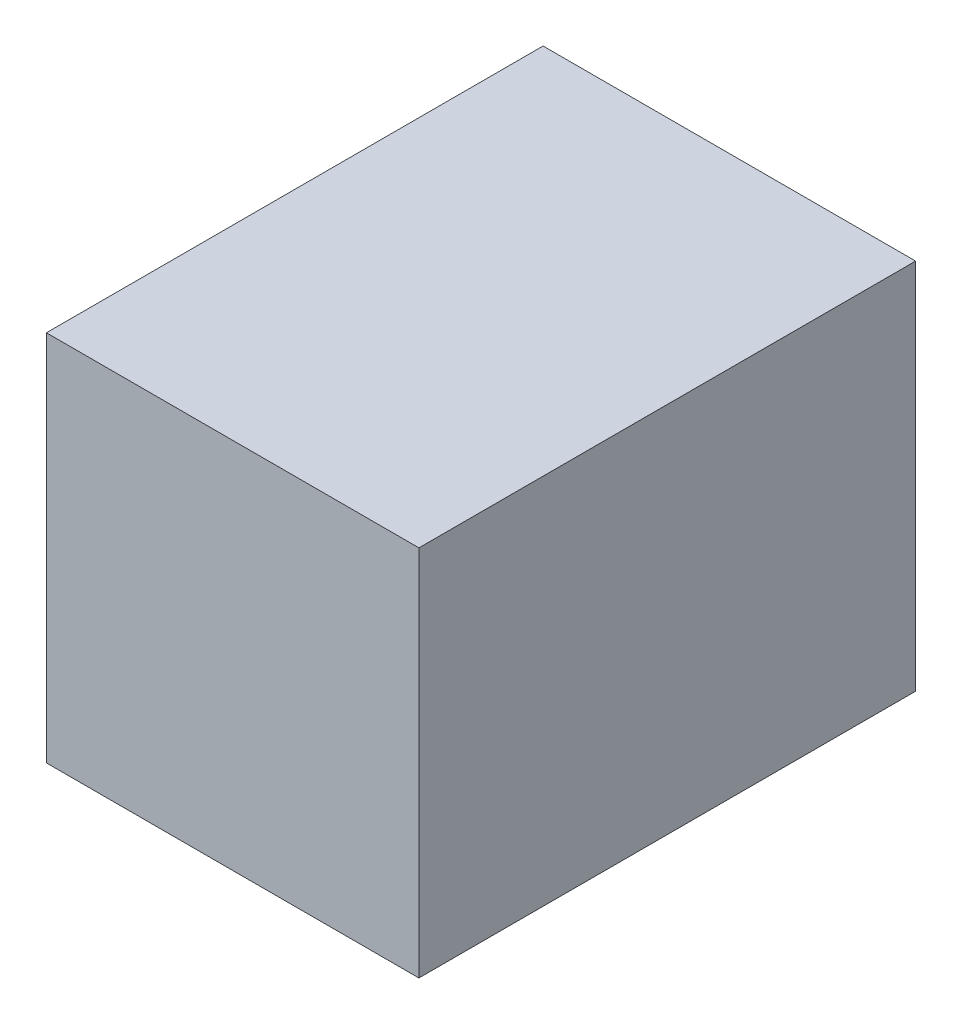
ISO-10303-21;
HEADER;
FILE_DESCRIPTION(('STEP AP214'),'2;1');
FILE_NAME('part.step','',(''),(''),'','','');
FILE_SCHEMA(('AUTOMOTIVE_DESIGN { 1 0 10303 214 1 1 1 1 }'));
ENDSEC;
DATA;
#1=APPLICATION_CONTEXT('core data for automotive mechanical design processes');
#2=APPLICATION_PROTOCOL_DEFINITION('international standard','automotive_design',2000,#1);
#3=PRODUCT_CONTEXT('',#1,'mechanical');
#4=PRODUCT('Part','Part','',(#3));
#5=PRODUCT_RELATED_PRODUCT_CATEGORY('part','',(#4));
#6=PRODUCT_DEFINITION_FORMATION('','',#4);
#7=PRODUCT_DEFINITION_CONTEXT('part definition',#1,'design');
#8=PRODUCT_DEFINITION('design','',#6,#7);
#9=PRODUCT_DEFINITION_SHAPE('','',#8);
#10=(LENGTH_UNIT() NAMED_UNIT(*) SI_UNIT(.MILLI.,.METRE.));
#11=(NAMED_UNIT(*) PLANE_ANGLE_UNIT() SI_UNIT($,.RADIAN.));
#12=(NAMED_UNIT(*) SI_UNIT($,.STERADIAN.) SOLID_ANGLE_UNIT());
#13=UNCERTAINTY_MEASURE_WITH_UNIT(LENGTH_MEASURE(1.E-05),#10,'distance_accuracy_value','');
#14=(GEOMETRIC_REPRESENTATION_CONTEXT(3) GLOBAL_UNCERTAINTY_ASSIGNED_CONTEXT((#13)) GLOBAL_UNIT_ASSIGNED_CONTEXT((#10,
#11,#12)) REPRESENTATION_CONTEXT('',''));
#15=CARTESIAN_POINT('',(0.,0.,0.));
#16=DIRECTION('',(0.,0.,1.));
#17=DIRECTION('',(1.,0.,0.));
#18=AXIS2_PLACEMENT_3D('',#15,#16,#17);
#19=CARTESIAN_POINT('',(3.,-3.,8.));
#20=DIRECTION('',(-1.,0.,0.));
#21=DIRECTION('',(0.,0.,1.));
#22=AXIS2_PLACEMENT_3D('',#19,#20,#21);
#23=PLANE('',#22);
#24=DIRECTION('',(0.,1.,0.));
#25=VECTOR('',#24,1.);
#26=CARTESIAN_POINT('',(3.,-3.,0.));
#27=LINE('',#26,#25);
#28=CARTESIAN_POINT('',(3.,-3.,0.));
#29=VERTEX_POINT('',#28);
#30=CARTESIAN_POINT('',(3.,3.,0.));
#31=VERTEX_POINT('',#30);
#32=EDGE_CURVE('E96',#29,#31,#27,.T.);
#33=ORIENTED_EDGE('',*,*,#32,.T.);
#34=DIRECTION('',(0.,0.,-1.));
#35=VECTOR('',#34,1.);
#36=CARTESIAN_POINT('',(3.,3.,8.));
#37=LINE('',#36,#35);
#38=CARTESIAN_POINT('',(3.,3.,8.));
#39=VERTEX_POINT('',#38);
#40=EDGE_CURVE('E11',#39,#31,#37,.T.);
#41=ORIENTED_EDGE('',*,*,#40,.F.);
#42=DIRECTION('',(0.,1.,0.));
#43=VECTOR('',#42,1.);
#44=CARTESIAN_POINT('',(3.,-3.,8.));
#45=LINE('',#44,#43);
#46=CARTESIAN_POINT('',(3.,-3.,8.));
#47=VERTEX_POINT('',#46);
#48=EDGE_CURVE('E84',#47,#39,#45,.T.);
#49=ORIENTED_EDGE('',*,*,#48,.F.);
#50=DIRECTION('',(0.,0.,-1.));
#51=VECTOR('',#50,1.);
#52=CARTESIAN_POINT('',(3.,-3.,8.));
#53=LINE('',#52,#51);
#54=EDGE_CURVE('E92',#47,#29,#53,.T.);
#55=ORIENTED_EDGE('',*,*,#54,.T.);
#56=EDGE_LOOP('',(#33,#41,#49,#55));
#57=FACE_BOUND('',#56,.T.);
#58=ADVANCED_FACE('F33',(#57),#23,.F.);
#59=CARTESIAN_POINT('',(-3.,3.,8.));
#60=DIRECTION('',(0.,-1.,0.));
#61=DIRECTION('',(0.,0.,-1.));
#62=AXIS2_PLACEMENT_3D('',#59,#60,#61);
#63=PLANE('',#62);
#64=DIRECTION('',(-1.,0.,0.));
#65=VECTOR('',#64,1.);
#66=CARTESIAN_POINT('',(-3.,3.,0.));
#67=LINE('',#66,#65);
#68=CARTESIAN_POINT('',(-3.,3.,0.));
#69=VERTEX_POINT('',#68);
#70=EDGE_CURVE('E88',#31,#69,#67,.T.);
#71=ORIENTED_EDGE('',*,*,#70,.T.);
#72=DIRECTION('',(0.,0.,-1.));
#73=VECTOR('',#72,1.);
#74=CARTESIAN_POINT('',(-3.,3.,8.));
#75=LINE('',#74,#73);
#76=CARTESIAN_POINT('',(-3.,3.,8.));
#77=VERTEX_POINT('',#76);
#78=EDGE_CURVE('E41',#77,#69,#75,.T.);
#79=ORIENTED_EDGE('',*,*,#78,.F.);
#80=DIRECTION('',(-1.,0.,0.));
#81=VECTOR('',#80,1.);
#82=CARTESIAN_POINT('',(-3.,3.,8.));
#83=LINE('',#82,#81);
#84=EDGE_CURVE('E79',#39,#77,#83,.T.);
#85=ORIENTED_EDGE('',*,*,#84,.F.);
#86=ORIENTED_EDGE('',*,*,#40,.T.);
#87=EDGE_LOOP('',(#71,#79,#85,#86));
#88=FACE_BOUND('',#87,.T.);
#89=ADVANCED_FACE('F87',(#88),#63,.F.);
#90=CARTESIAN_POINT('',(-3.,-3.,8.));
#91=DIRECTION('',(1.,0.,0.));
#92=DIRECTION('',(0.,0.,-1.));
#93=AXIS2_PLACEMENT_3D('',#90,#91,#92);
#94=PLANE('',#93);
#95=DIRECTION('',(0.,-1.,0.));
#96=VECTOR('',#95,1.);
#97=CARTESIAN_POINT('',(-3.,-3.,0.));
#98=LINE('',#97,#96);
#99=CARTESIAN_POINT('',(-3.,-3.,0.));
#100=VERTEX_POINT('',#99);
#101=EDGE_CURVE('E66',#69,#100,#98,.T.);
#102=ORIENTED_EDGE('',*,*,#101,.T.);
#103=DIRECTION('',(0.,0.,-1.));
#104=VECTOR('',#103,1.);
#105=CARTESIAN_POINT('',(-3.,-3.,8.));
#106=LINE('',#105,#104);
#107=CARTESIAN_POINT('',(-3.,-3.,8.));
#108=VERTEX_POINT('',#107);
#109=EDGE_CURVE('E89',#108,#100,#106,.T.);
#110=ORIENTED_EDGE('',*,*,#109,.F.);
#111=DIRECTION('',(0.,-1.,0.));
#112=VECTOR('',#111,1.);
#113=CARTESIAN_POINT('',(-3.,-3.,8.));
#114=LINE('',#113,#112);
#115=EDGE_CURVE('E82',#77,#108,#114,.T.);
#116=ORIENTED_EDGE('',*,*,#115,.F.);
#117=ORIENTED_EDGE('',*,*,#78,.T.);
#118=EDGE_LOOP('',(#102,#110,#116,#117));
#119=FACE_BOUND('',#118,.T.);
#120=ADVANCED_FACE('F90',(#119),#94,.F.);
#121=CARTESIAN_POINT('',(-3.,-3.,8.));
#122=DIRECTION('',(0.,1.,0.));
#123=DIRECTION('',(0.,0.,1.));
#124=AXIS2_PLACEMENT_3D('',#121,#122,#123);
#125=PLANE('',#124);
#126=DIRECTION('',(1.,0.,0.));
#127=VECTOR('',#126,1.);
#128=CARTESIAN_POINT('',(-3.,-3.,0.));
#129=LINE('',#128,#127);
#130=EDGE_CURVE('E72',#100,#29,#129,.T.);
#131=ORIENTED_EDGE('',*,*,#130,.T.);
#132=ORIENTED_EDGE('',*,*,#54,.F.);
#133=DIRECTION('',(1.,0.,0.));
#134=VECTOR('',#133,1.);
#135=CARTESIAN_POINT('',(-3.,-3.,8.));
#136=LINE('',#135,#134);
#137=EDGE_CURVE('E49',#108,#47,#136,.T.);
#138=ORIENTED_EDGE('',*,*,#137,.F.);
#139=ORIENTED_EDGE('',*,*,#109,.T.);
#140=EDGE_LOOP('',(#131,#132,#138,#139));
#141=FACE_BOUND('',#140,.T.);
#142=ADVANCED_FACE('F103',(#141),#125,.F.);
#143=CARTESIAN_POINT('',(0.,0.,8.));
#144=DIRECTION('',(0.,0.,-1.));
#145=DIRECTION('',(-1.,0.,0.));
#146=AXIS2_PLACEMENT_3D('',#143,#144,#145);
#147=PLANE('',#146);
#148=ORIENTED_EDGE('',*,*,#48,.T.);
#149=ORIENTED_EDGE('',*,*,#84,.T.);
#150=ORIENTED_EDGE('',*,*,#115,.T.);
#151=ORIENTED_EDGE('',*,*,#137,.T.);
#152=EDGE_LOOP('',(#148,#149,#150,#151));
#153=FACE_BOUND('',#152,.T.);
#154=ADVANCED_FACE('F80',(#153),#147,.F.);
#155=CARTESIAN_POINT('',(0.,0.,0.));
#156=DIRECTION('',(0.,0.,-1.));
#157=DIRECTION('',(-1.,0.,0.));
#158=AXIS2_PLACEMENT_3D('',#155,#156,#157);
#159=PLANE('',#158);
#160=ORIENTED_EDGE('',*,*,#32,.F.);
#161=ORIENTED_EDGE('',*,*,#130,.F.);
#162=ORIENTED_EDGE('',*,*,#101,.F.);
#163=ORIENTED_EDGE('',*,*,#70,.F.);
#164=EDGE_LOOP('',(#160,#161,#162,#163));
#165=FACE_BOUND('',#164,.T.);
#166=ADVANCED_FACE('F106',(#165),#159,.T.);
#167=CLOSED_SHELL('',(#58,#89,#120,#142,#154,#166));
#168=MANIFOLD_SOLID_BREP('B2',#167);
#169=ADVANCED_BREP_SHAPE_REPRESENTATION('',(#18,#168),#14);
#170=SHAPE_DEFINITION_REPRESENTATION(#9,#169);
ENDSEC;
END-ISO-10303-21;
